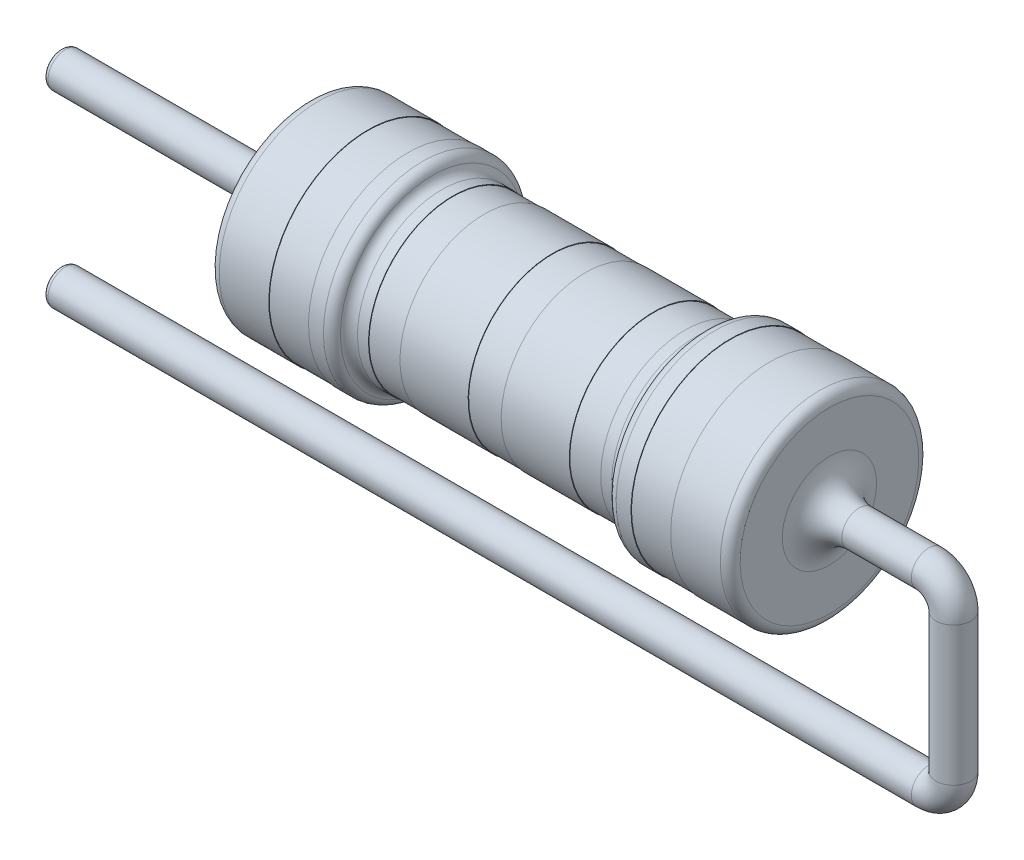
ISO-10303-21;
HEADER;
FILE_DESCRIPTION(('STEP AP214'),'2;1');
FILE_NAME('part.step','',(''),(''),'','','');
FILE_SCHEMA(('AUTOMOTIVE_DESIGN { 1 0 10303 214 1 1 1 1 }'));
ENDSEC;
DATA;
#1=APPLICATION_CONTEXT('core data for automotive mechanical design processes');
#2=APPLICATION_PROTOCOL_DEFINITION('international standard','automotive_design',2000,#1);
#3=PRODUCT_CONTEXT('',#1,'mechanical');
#4=PRODUCT('Part','Part','',(#3));
#5=PRODUCT_RELATED_PRODUCT_CATEGORY('part','',(#4));
#6=PRODUCT_DEFINITION_FORMATION('','',#4);
#7=PRODUCT_DEFINITION_CONTEXT('part definition',#1,'design');
#8=PRODUCT_DEFINITION('design','',#6,#7);
#9=PRODUCT_DEFINITION_SHAPE('','',#8);
#10=(LENGTH_UNIT() NAMED_UNIT(*) SI_UNIT(.MILLI.,.METRE.));
#11=(NAMED_UNIT(*) PLANE_ANGLE_UNIT() SI_UNIT($,.RADIAN.));
#12=(NAMED_UNIT(*) SI_UNIT($,.STERADIAN.) SOLID_ANGLE_UNIT());
#13=UNCERTAINTY_MEASURE_WITH_UNIT(LENGTH_MEASURE(1.E-05),#10,'distance_accuracy_value','');
#14=(GEOMETRIC_REPRESENTATION_CONTEXT(3) GLOBAL_UNCERTAINTY_ASSIGNED_CONTEXT((#13)) GLOBAL_UNIT_ASSIGNED_CONTEXT((#10,
#11,#12)) REPRESENTATION_CONTEXT('',''));
#15=CARTESIAN_POINT('',(0.,0.,0.));
#16=DIRECTION('',(0.,0.,1.));
#17=DIRECTION('',(1.,0.,0.));
#18=AXIS2_PLACEMENT_3D('',#15,#16,#17);
#19=CARTESIAN_POINT('',(5.25,0.,0.));
#20=DIRECTION('',(1.,0.,0.));
#21=DIRECTION('',(0.,1.,0.));
#22=AXIS2_PLACEMENT_3D('',#19,#20,#21);
#23=PLANE('',#22);
#24=CARTESIAN_POINT('',(5.25,0.,0.));
#25=DIRECTION('',(1.,0.,0.));
#26=DIRECTION('',(0.,1.,0.));
#27=AXIS2_PLACEMENT_3D('',#24,#25,#26);
#28=CIRCLE('',#27,0.95);
#29=CARTESIAN_POINT('',(5.25,0.95,0.));
#30=VERTEX_POINT('',#29);
#31=EDGE_CURVE('E45',#30,#30,#28,.F.);
#32=ORIENTED_EDGE('',*,*,#31,.T.);
#33=EDGE_LOOP('',(#32));
#34=FACE_BOUND('',#33,.T.);
#35=CARTESIAN_POINT('',(5.25,0.,0.));
#36=DIRECTION('',(1.,0.,0.));
#37=DIRECTION('',(0.,1.,0.));
#38=AXIS2_PLACEMENT_3D('',#35,#36,#37);
#39=CIRCLE('',#38,1.8);
#40=CARTESIAN_POINT('',(5.25,1.8,0.));
#41=VERTEX_POINT('',#40);
#42=EDGE_CURVE('E66',#41,#41,#39,.T.);
#43=ORIENTED_EDGE('',*,*,#42,.T.);
#44=EDGE_LOOP('',(#43));
#45=FACE_BOUND('',#44,.T.);
#46=ADVANCED_FACE('F34',(#34,#45),#23,.T.);
#47=CARTESIAN_POINT('',(-5.25,0.,0.));
#48=DIRECTION('',(-1.,0.,0.));
#49=DIRECTION('',(0.,-1.,0.));
#50=AXIS2_PLACEMENT_3D('',#47,#48,#49);
#51=CYLINDRICAL_SURFACE('',#50,2.);
#52=CARTESIAN_POINT('',(5.05,0.,0.));
#53=DIRECTION('',(1.,0.,0.));
#54=DIRECTION('',(0.,1.,0.));
#55=AXIS2_PLACEMENT_3D('',#52,#53,#54);
#56=CIRCLE('',#55,2.);
#57=CARTESIAN_POINT('',(5.05,2.,0.));
#58=VERTEX_POINT('',#57);
#59=EDGE_CURVE('E69',#58,#58,#56,.F.);
#60=ORIENTED_EDGE('',*,*,#59,.T.);
#61=EDGE_LOOP('',(#60));
#62=FACE_BOUND('',#61,.T.);
#63=CARTESIAN_POINT('',(4.05,0.,0.));
#64=DIRECTION('',(-1.,0.,0.));
#65=DIRECTION('',(0.,-1.,0.));
#66=AXIS2_PLACEMENT_3D('',#63,#64,#65);
#67=CIRCLE('',#66,2.);
#68=CARTESIAN_POINT('',(4.05,-2.,0.));
#69=VERTEX_POINT('',#68);
#70=EDGE_CURVE('E96',#69,#69,#67,.T.);
#71=ORIENTED_EDGE('',*,*,#70,.F.);
#72=EDGE_LOOP('',(#71));
#73=FACE_BOUND('',#72,.T.);
#74=ADVANCED_FACE('F187',(#62,#73),#51,.T.);
#75=CARTESIAN_POINT('',(4.05,-2.,0.));
#76=DIRECTION('',(-1.,0.,0.));
#77=DIRECTION('',(0.,-1.,0.));
#78=AXIS2_PLACEMENT_3D('',#75,#76,#77);
#79=PLANE('',#78);
#80=ORIENTED_EDGE('',*,*,#70,.T.);
#81=EDGE_LOOP('',(#80));
#82=FACE_BOUND('',#81,.T.);
#83=CARTESIAN_POINT('',(4.05,0.,0.));
#84=DIRECTION('',(-1.,0.,0.));
#85=DIRECTION('',(0.,-1.,0.));
#86=AXIS2_PLACEMENT_3D('',#83,#84,#85);
#87=CIRCLE('',#86,1.99);
#88=CARTESIAN_POINT('',(4.05,-1.99,0.));
#89=VERTEX_POINT('',#88);
#90=EDGE_CURVE('E99',#89,#89,#87,.T.);
#91=ORIENTED_EDGE('',*,*,#90,.F.);
#92=EDGE_LOOP('',(#91));
#93=FACE_BOUND('',#92,.T.);
#94=ADVANCED_FACE('F193',(#82,#93),#79,.T.);
#95=CARTESIAN_POINT('',(-5.25,0.,0.));
#96=DIRECTION('',(-1.,0.,0.));
#97=DIRECTION('',(0.,-1.,0.));
#98=AXIS2_PLACEMENT_3D('',#95,#96,#97);
#99=CYLINDRICAL_SURFACE('',#98,1.99);
#100=ORIENTED_EDGE('',*,*,#90,.T.);
#101=EDGE_LOOP('',(#100));
#102=FACE_BOUND('',#101,.T.);
#103=CARTESIAN_POINT('',(3.25,0.,0.));
#104=DIRECTION('',(-1.,0.,0.));
#105=DIRECTION('',(0.,-1.,0.));
#106=AXIS2_PLACEMENT_3D('',#103,#104,#105);
#107=CIRCLE('',#106,1.99);
#108=CARTESIAN_POINT('',(3.25,-1.99,0.));
#109=VERTEX_POINT('',#108);
#110=EDGE_CURVE('E102',#109,#109,#107,.T.);
#111=ORIENTED_EDGE('',*,*,#110,.F.);
#112=EDGE_LOOP('',(#111));
#113=FACE_BOUND('',#112,.T.);
#114=ADVANCED_FACE('F596',(#102,#113),#99,.T.);
#115=CARTESIAN_POINT('',(3.25,-1.99,0.));
#116=DIRECTION('',(1.,0.,0.));
#117=DIRECTION('',(0.,1.,0.));
#118=AXIS2_PLACEMENT_3D('',#115,#116,#117);
#119=PLANE('',#118);
#120=ORIENTED_EDGE('',*,*,#110,.T.);
#121=EDGE_LOOP('',(#120));
#122=FACE_BOUND('',#121,.T.);
#123=CARTESIAN_POINT('',(3.25,0.,0.));
#124=DIRECTION('',(-1.,0.,0.));
#125=DIRECTION('',(0.,-1.,0.));
#126=AXIS2_PLACEMENT_3D('',#123,#124,#125);
#127=CIRCLE('',#126,2.);
#128=CARTESIAN_POINT('',(3.25,-2.,0.));
#129=VERTEX_POINT('',#128);
#130=EDGE_CURVE('E105',#129,#129,#127,.T.);
#131=ORIENTED_EDGE('',*,*,#130,.F.);
#132=EDGE_LOOP('',(#131));
#133=FACE_BOUND('',#132,.T.);
#134=ADVANCED_FACE('F443',(#122,#133),#119,.T.);
#135=CARTESIAN_POINT('',(-5.25,0.,0.));
#136=DIRECTION('',(-1.,0.,0.));
#137=DIRECTION('',(0.,-1.,0.));
#138=AXIS2_PLACEMENT_3D('',#135,#136,#137);
#139=CYLINDRICAL_SURFACE('',#138,2.);
#140=CARTESIAN_POINT('',(2.95,0.,0.));
#141=DIRECTION('',(-1.,0.,0.));
#142=DIRECTION('',(0.,-1.,0.));
#143=AXIS2_PLACEMENT_3D('',#140,#141,#142);
#144=CIRCLE('',#143,2.);
#145=CARTESIAN_POINT('',(2.95,-2.,0.));
#146=VERTEX_POINT('',#145);
#147=EDGE_CURVE('E84',#146,#146,#144,.F.);
#148=ORIENTED_EDGE('',*,*,#147,.T.);
#149=EDGE_LOOP('',(#148));
#150=FACE_BOUND('',#149,.T.);
#151=ORIENTED_EDGE('',*,*,#130,.T.);
#152=EDGE_LOOP('',(#151));
#153=FACE_BOUND('',#152,.T.);
#154=ADVANCED_FACE('F405',(#150,#153),#139,.T.);
#155=CARTESIAN_POINT('',(-5.25,0.,0.));
#156=DIRECTION('',(-1.,0.,0.));
#157=DIRECTION('',(0.,-1.,0.));
#158=AXIS2_PLACEMENT_3D('',#155,#156,#157);
#159=CYLINDRICAL_SURFACE('',#158,1.7);
#160=CARTESIAN_POINT('',(2.5627016653792,0.,0.));
#161=DIRECTION('',(-1.,0.,0.));
#162=DIRECTION('',(0.,-1.,0.));
#163=AXIS2_PLACEMENT_3D('',#160,#161,#162);
#164=CIRCLE('',#163,1.7);
#165=CARTESIAN_POINT('',(2.5627016653792,-1.7,0.));
#166=VERTEX_POINT('',#165);
#167=EDGE_CURVE('E81',#166,#166,#164,.T.);
#168=ORIENTED_EDGE('',*,*,#167,.T.);
#169=EDGE_LOOP('',(#168));
#170=FACE_BOUND('',#169,.T.);
#171=CARTESIAN_POINT('',(2.34069006093189,0.,0.));
#172=DIRECTION('',(-1.,0.,0.));
#173=DIRECTION('',(0.,-1.,0.));
#174=AXIS2_PLACEMENT_3D('',#171,#172,#173);
#175=CIRCLE('',#174,1.7);
#176=CARTESIAN_POINT('',(2.34069006093189,-1.7,0.));
#177=VERTEX_POINT('',#176);
#178=EDGE_CURVE('E108',#177,#177,#175,.T.);
#179=ORIENTED_EDGE('',*,*,#178,.F.);
#180=EDGE_LOOP('',(#179));
#181=FACE_BOUND('',#180,.T.);
#182=ADVANCED_FACE('F399',(#170,#181),#159,.T.);
#183=CARTESIAN_POINT('',(2.3406900609319,-1.7,0.));
#184=DIRECTION('',(-1.,0.,0.));
#185=DIRECTION('',(0.,-1.,0.));
#186=AXIS2_PLACEMENT_3D('',#183,#184,#185);
#187=PLANE('',#186);
#188=ORIENTED_EDGE('',*,*,#178,.T.);
#189=EDGE_LOOP('',(#188));
#190=FACE_BOUND('',#189,.T.);
#191=CARTESIAN_POINT('',(2.34069006093189,0.,0.));
#192=DIRECTION('',(-1.,0.,0.));
#193=DIRECTION('',(0.,-1.,0.));
#194=AXIS2_PLACEMENT_3D('',#191,#192,#193);
#195=CIRCLE('',#194,1.69);
#196=CARTESIAN_POINT('',(2.34069006093189,-1.69,0.));
#197=VERTEX_POINT('',#196);
#198=EDGE_CURVE('E111',#197,#197,#195,.T.);
#199=ORIENTED_EDGE('',*,*,#198,.F.);
#200=EDGE_LOOP('',(#199));
#201=FACE_BOUND('',#200,.T.);
#202=ADVANCED_FACE('F404',(#190,#201),#187,.T.);
#203=CARTESIAN_POINT('',(-5.25,0.,0.));
#204=DIRECTION('',(-1.,0.,0.));
#205=DIRECTION('',(0.,-1.,0.));
#206=AXIS2_PLACEMENT_3D('',#203,#204,#205);
#207=CYLINDRICAL_SURFACE('',#206,1.69);
#208=ORIENTED_EDGE('',*,*,#198,.T.);
#209=EDGE_LOOP('',(#208));
#210=FACE_BOUND('',#209,.T.);
#211=CARTESIAN_POINT('',(1.70680528042174,0.,0.));
#212=DIRECTION('',(-1.,0.,0.));
#213=DIRECTION('',(0.,-1.,0.));
#214=AXIS2_PLACEMENT_3D('',#211,#212,#213);
#215=CIRCLE('',#214,1.69);
#216=CARTESIAN_POINT('',(1.70680528042174,-1.69,0.));
#217=VERTEX_POINT('',#216);
#218=EDGE_CURVE('E114',#217,#217,#215,.T.);
#219=ORIENTED_EDGE('',*,*,#218,.F.);
#220=EDGE_LOOP('',(#219));
#221=FACE_BOUND('',#220,.T.);
#222=ADVANCED_FACE('F571',(#210,#221),#207,.T.);
#223=CARTESIAN_POINT('',(1.70680528042174,-1.69,0.));
#224=DIRECTION('',(1.,0.,0.));
#225=DIRECTION('',(0.,1.,0.));
#226=AXIS2_PLACEMENT_3D('',#223,#224,#225);
#227=PLANE('',#226);
#228=ORIENTED_EDGE('',*,*,#218,.T.);
#229=EDGE_LOOP('',(#228));
#230=FACE_BOUND('',#229,.T.);
#231=CARTESIAN_POINT('',(1.70680528042174,0.,0.));
#232=DIRECTION('',(-1.,0.,0.));
#233=DIRECTION('',(0.,-1.,0.));
#234=AXIS2_PLACEMENT_3D('',#231,#232,#233);
#235=CIRCLE('',#234,1.7);
#236=CARTESIAN_POINT('',(1.70680528042174,-1.7,0.));
#237=VERTEX_POINT('',#236);
#238=EDGE_CURVE('E117',#237,#237,#235,.T.);
#239=ORIENTED_EDGE('',*,*,#238,.F.);
#240=EDGE_LOOP('',(#239));
#241=FACE_BOUND('',#240,.T.);
#242=ADVANCED_FACE('F561',(#230,#241),#227,.T.);
#243=CARTESIAN_POINT('',(-5.25,0.,0.));
#244=DIRECTION('',(-1.,0.,0.));
#245=DIRECTION('',(0.,-1.,0.));
#246=AXIS2_PLACEMENT_3D('',#243,#244,#245);
#247=CYLINDRICAL_SURFACE('',#246,1.7);
#248=ORIENTED_EDGE('',*,*,#238,.T.);
#249=EDGE_LOOP('',(#248));
#250=FACE_BOUND('',#249,.T.);
#251=CARTESIAN_POINT('',(0.332543076275725,0.,0.));
#252=DIRECTION('',(-1.,0.,0.));
#253=DIRECTION('',(0.,-1.,0.));
#254=AXIS2_PLACEMENT_3D('',#251,#252,#253);
#255=CIRCLE('',#254,1.7);
#256=CARTESIAN_POINT('',(0.332543076275725,-1.7,0.));
#257=VERTEX_POINT('',#256);
#258=EDGE_CURVE('E120',#257,#257,#255,.T.);
#259=ORIENTED_EDGE('',*,*,#258,.F.);
#260=EDGE_LOOP('',(#259));
#261=FACE_BOUND('',#260,.T.);
#262=ADVANCED_FACE('F551',(#250,#261),#247,.T.);
#263=CARTESIAN_POINT('',(0.332543076275725,-1.7,0.));
#264=DIRECTION('',(-1.,0.,0.));
#265=DIRECTION('',(0.,-1.,0.));
#266=AXIS2_PLACEMENT_3D('',#263,#264,#265);
#267=PLANE('',#266);
#268=ORIENTED_EDGE('',*,*,#258,.T.);
#269=EDGE_LOOP('',(#268));
#270=FACE_BOUND('',#269,.T.);
#271=CARTESIAN_POINT('',(0.332543076275725,0.,0.));
#272=DIRECTION('',(-1.,0.,0.));
#273=DIRECTION('',(0.,-1.,0.));
#274=AXIS2_PLACEMENT_3D('',#271,#272,#273);
#275=CIRCLE('',#274,1.69);
#276=CARTESIAN_POINT('',(0.332543076275725,-1.69,0.));
#277=VERTEX_POINT('',#276);
#278=EDGE_CURVE('E123',#277,#277,#275,.T.);
#279=ORIENTED_EDGE('',*,*,#278,.F.);
#280=EDGE_LOOP('',(#279));
#281=FACE_BOUND('',#280,.T.);
#282=ADVANCED_FACE('F540',(#270,#281),#267,.T.);
#283=CARTESIAN_POINT('',(-5.25,0.,0.));
#284=DIRECTION('',(-1.,0.,0.));
#285=DIRECTION('',(0.,-1.,0.));
#286=AXIS2_PLACEMENT_3D('',#283,#284,#285);
#287=CYLINDRICAL_SURFACE('',#286,1.69);
#288=ORIENTED_EDGE('',*,*,#278,.T.);
#289=EDGE_LOOP('',(#288));
#290=FACE_BOUND('',#289,.T.);
#291=CARTESIAN_POINT('',(-0.332543076275725,0.,0.));
#292=DIRECTION('',(-1.,0.,0.));
#293=DIRECTION('',(0.,-1.,0.));
#294=AXIS2_PLACEMENT_3D('',#291,#292,#293);
#295=CIRCLE('',#294,1.69);
#296=CARTESIAN_POINT('',(-0.332543076275725,-1.69,0.));
#297=VERTEX_POINT('',#296);
#298=EDGE_CURVE('E126',#297,#297,#295,.T.);
#299=ORIENTED_EDGE('',*,*,#298,.F.);
#300=EDGE_LOOP('',(#299));
#301=FACE_BOUND('',#300,.T.);
#302=ADVANCED_FACE('F530',(#290,#301),#287,.T.);
#303=CARTESIAN_POINT('',(-0.332543076275725,-1.7,0.));
#304=DIRECTION('',(1.,0.,0.));
#305=DIRECTION('',(0.,1.,0.));
#306=AXIS2_PLACEMENT_3D('',#303,#304,#305);
#307=PLANE('',#306);
#308=ORIENTED_EDGE('',*,*,#298,.T.);
#309=EDGE_LOOP('',(#308));
#310=FACE_BOUND('',#309,.T.);
#311=CARTESIAN_POINT('',(-0.332543076275725,0.,0.));
#312=DIRECTION('',(-1.,0.,0.));
#313=DIRECTION('',(0.,-1.,0.));
#314=AXIS2_PLACEMENT_3D('',#311,#312,#313);
#315=CIRCLE('',#314,1.7);
#316=CARTESIAN_POINT('',(-0.332543076275725,-1.7,0.));
#317=VERTEX_POINT('',#316);
#318=EDGE_CURVE('E129',#317,#317,#315,.T.);
#319=ORIENTED_EDGE('',*,*,#318,.F.);
#320=EDGE_LOOP('',(#319));
#321=FACE_BOUND('',#320,.T.);
#322=ADVANCED_FACE('F520',(#310,#321),#307,.T.);
#323=CARTESIAN_POINT('',(-5.25,0.,0.));
#324=DIRECTION('',(-1.,0.,0.));
#325=DIRECTION('',(0.,-1.,0.));
#326=AXIS2_PLACEMENT_3D('',#323,#324,#325);
#327=CYLINDRICAL_SURFACE('',#326,1.7);
#328=ORIENTED_EDGE('',*,*,#318,.T.);
#329=EDGE_LOOP('',(#328));
#330=FACE_BOUND('',#329,.T.);
#331=CARTESIAN_POINT('',(-1.70680528042174,0.,0.));
#332=DIRECTION('',(-1.,0.,0.));
#333=DIRECTION('',(0.,-1.,0.));
#334=AXIS2_PLACEMENT_3D('',#331,#332,#333);
#335=CIRCLE('',#334,1.7);
#336=CARTESIAN_POINT('',(-1.70680528042174,-1.7,0.));
#337=VERTEX_POINT('',#336);
#338=EDGE_CURVE('E132',#337,#337,#335,.T.);
#339=ORIENTED_EDGE('',*,*,#338,.F.);
#340=EDGE_LOOP('',(#339));
#341=FACE_BOUND('',#340,.T.);
#342=ADVANCED_FACE('F510',(#330,#341),#327,.T.);
#343=CARTESIAN_POINT('',(-1.70680528042174,-1.69,0.));
#344=DIRECTION('',(-1.,0.,0.));
#345=DIRECTION('',(0.,-1.,0.));
#346=AXIS2_PLACEMENT_3D('',#343,#344,#345);
#347=PLANE('',#346);
#348=ORIENTED_EDGE('',*,*,#338,.T.);
#349=EDGE_LOOP('',(#348));
#350=FACE_BOUND('',#349,.T.);
#351=CARTESIAN_POINT('',(-1.70680528042174,0.,0.));
#352=DIRECTION('',(-1.,0.,0.));
#353=DIRECTION('',(0.,-1.,0.));
#354=AXIS2_PLACEMENT_3D('',#351,#352,#353);
#355=CIRCLE('',#354,1.69);
#356=CARTESIAN_POINT('',(-1.70680528042174,-1.69,0.));
#357=VERTEX_POINT('',#356);
#358=EDGE_CURVE('E135',#357,#357,#355,.T.);
#359=ORIENTED_EDGE('',*,*,#358,.F.);
#360=EDGE_LOOP('',(#359));
#361=FACE_BOUND('',#360,.T.);
#362=ADVANCED_FACE('F499',(#350,#361),#347,.T.);
#363=CARTESIAN_POINT('',(-5.25,0.,0.));
#364=DIRECTION('',(-1.,0.,0.));
#365=DIRECTION('',(0.,-1.,0.));
#366=AXIS2_PLACEMENT_3D('',#363,#364,#365);
#367=CYLINDRICAL_SURFACE('',#366,1.69);
#368=ORIENTED_EDGE('',*,*,#358,.T.);
#369=EDGE_LOOP('',(#368));
#370=FACE_BOUND('',#369,.T.);
#371=CARTESIAN_POINT('',(-2.3406900609319,0.,0.));
#372=DIRECTION('',(-1.,0.,0.));
#373=DIRECTION('',(0.,-1.,0.));
#374=AXIS2_PLACEMENT_3D('',#371,#372,#373);
#375=CIRCLE('',#374,1.69);
#376=CARTESIAN_POINT('',(-2.3406900609319,-1.69,0.));
#377=VERTEX_POINT('',#376);
#378=EDGE_CURVE('E138',#377,#377,#375,.T.);
#379=ORIENTED_EDGE('',*,*,#378,.F.);
#380=EDGE_LOOP('',(#379));
#381=FACE_BOUND('',#380,.T.);
#382=ADVANCED_FACE('F489',(#370,#381),#367,.T.);
#383=CARTESIAN_POINT('',(-2.3406900609319,-1.7,0.));
#384=DIRECTION('',(1.,0.,0.));
#385=DIRECTION('',(0.,1.,0.));
#386=AXIS2_PLACEMENT_3D('',#383,#384,#385);
#387=PLANE('',#386);
#388=ORIENTED_EDGE('',*,*,#378,.T.);
#389=EDGE_LOOP('',(#388));
#390=FACE_BOUND('',#389,.T.);
#391=CARTESIAN_POINT('',(-2.3406900609319,0.,0.));
#392=DIRECTION('',(-1.,0.,0.));
#393=DIRECTION('',(0.,-1.,0.));
#394=AXIS2_PLACEMENT_3D('',#391,#392,#393);
#395=CIRCLE('',#394,1.7);
#396=CARTESIAN_POINT('',(-2.3406900609319,-1.7,0.));
#397=VERTEX_POINT('',#396);
#398=EDGE_CURVE('E141',#397,#397,#395,.T.);
#399=ORIENTED_EDGE('',*,*,#398,.F.);
#400=EDGE_LOOP('',(#399));
#401=FACE_BOUND('',#400,.T.);
#402=ADVANCED_FACE('F431',(#390,#401),#387,.T.);
#403=CARTESIAN_POINT('',(-5.25,0.,0.));
#404=DIRECTION('',(-1.,0.,0.));
#405=DIRECTION('',(0.,-1.,0.));
#406=AXIS2_PLACEMENT_3D('',#403,#404,#405);
#407=CYLINDRICAL_SURFACE('',#406,1.7);
#408=CARTESIAN_POINT('',(-2.56270166537917,0.,0.));
#409=DIRECTION('',(-1.,0.,0.));
#410=DIRECTION('',(0.,-1.,0.));
#411=AXIS2_PLACEMENT_3D('',#408,#409,#410);
#412=CIRCLE('',#411,1.7);
#413=CARTESIAN_POINT('',(-2.56270166537917,-1.7,0.));
#414=VERTEX_POINT('',#413);
#415=EDGE_CURVE('E87',#414,#414,#412,.F.);
#416=ORIENTED_EDGE('',*,*,#415,.T.);
#417=EDGE_LOOP('',(#416));
#418=FACE_BOUND('',#417,.T.);
#419=ORIENTED_EDGE('',*,*,#398,.T.);
#420=EDGE_LOOP('',(#419));
#421=FACE_BOUND('',#420,.T.);
#422=ADVANCED_FACE('F425',(#418,#421),#407,.T.);
#423=CARTESIAN_POINT('',(-5.25,0.,0.));
#424=DIRECTION('',(-1.,0.,0.));
#425=DIRECTION('',(0.,-1.,0.));
#426=AXIS2_PLACEMENT_3D('',#423,#424,#425);
#427=CYLINDRICAL_SURFACE('',#426,2.);
#428=CARTESIAN_POINT('',(-2.95,0.,0.));
#429=DIRECTION('',(1.,0.,0.));
#430=DIRECTION('',(0.,1.,0.));
#431=AXIS2_PLACEMENT_3D('',#428,#429,#430);
#432=CIRCLE('',#431,2.);
#433=CARTESIAN_POINT('',(-2.95,2.,0.));
#434=VERTEX_POINT('',#433);
#435=EDGE_CURVE('E93',#434,#434,#432,.F.);
#436=ORIENTED_EDGE('',*,*,#435,.T.);
#437=EDGE_LOOP('',(#436));
#438=FACE_BOUND('',#437,.T.);
#439=CARTESIAN_POINT('',(-3.25,0.,0.));
#440=DIRECTION('',(-1.,0.,0.));
#441=DIRECTION('',(0.,-1.,0.));
#442=AXIS2_PLACEMENT_3D('',#439,#440,#441);
#443=CIRCLE('',#442,2.);
#444=CARTESIAN_POINT('',(-3.25,-2.,0.));
#445=VERTEX_POINT('',#444);
#446=EDGE_CURVE('E144',#445,#445,#443,.T.);
#447=ORIENTED_EDGE('',*,*,#446,.F.);
#448=EDGE_LOOP('',(#447));
#449=FACE_BOUND('',#448,.T.);
#450=ADVANCED_FACE('F430',(#438,#449),#427,.T.);
#451=CARTESIAN_POINT('',(-3.25,-1.99,0.));
#452=DIRECTION('',(-1.,0.,0.));
#453=DIRECTION('',(0.,-1.,0.));
#454=AXIS2_PLACEMENT_3D('',#451,#452,#453);
#455=PLANE('',#454);
#456=ORIENTED_EDGE('',*,*,#446,.T.);
#457=EDGE_LOOP('',(#456));
#458=FACE_BOUND('',#457,.T.);
#459=CARTESIAN_POINT('',(-3.25,0.,0.));
#460=DIRECTION('',(-1.,0.,0.));
#461=DIRECTION('',(0.,-1.,0.));
#462=AXIS2_PLACEMENT_3D('',#459,#460,#461);
#463=CIRCLE('',#462,1.99);
#464=CARTESIAN_POINT('',(-3.25,-1.99,0.));
#465=VERTEX_POINT('',#464);
#466=EDGE_CURVE('E147',#465,#465,#463,.T.);
#467=ORIENTED_EDGE('',*,*,#466,.F.);
#468=EDGE_LOOP('',(#467));
#469=FACE_BOUND('',#468,.T.);
#470=ADVANCED_FACE('F453',(#458,#469),#455,.T.);
#471=CARTESIAN_POINT('',(-5.25,0.,0.));
#472=DIRECTION('',(-1.,0.,0.));
#473=DIRECTION('',(0.,-1.,0.));
#474=AXIS2_PLACEMENT_3D('',#471,#472,#473);
#475=CYLINDRICAL_SURFACE('',#474,1.99);
#476=ORIENTED_EDGE('',*,*,#466,.T.);
#477=EDGE_LOOP('',(#476));
#478=FACE_BOUND('',#477,.T.);
#479=CARTESIAN_POINT('',(-4.05,0.,0.));
#480=DIRECTION('',(-1.,0.,0.));
#481=DIRECTION('',(0.,-1.,0.));
#482=AXIS2_PLACEMENT_3D('',#479,#480,#481);
#483=CIRCLE('',#482,1.99);
#484=CARTESIAN_POINT('',(-4.05,-1.99,0.));
#485=VERTEX_POINT('',#484);
#486=EDGE_CURVE('E150',#485,#485,#483,.T.);
#487=ORIENTED_EDGE('',*,*,#486,.F.);
#488=EDGE_LOOP('',(#487));
#489=FACE_BOUND('',#488,.T.);
#490=ADVANCED_FACE('F463',(#478,#489),#475,.T.);
#491=CARTESIAN_POINT('',(-4.05,-2.,0.));
#492=DIRECTION('',(1.,0.,0.));
#493=DIRECTION('',(0.,1.,0.));
#494=AXIS2_PLACEMENT_3D('',#491,#492,#493);
#495=PLANE('',#494);
#496=ORIENTED_EDGE('',*,*,#486,.T.);
#497=EDGE_LOOP('',(#496));
#498=FACE_BOUND('',#497,.T.);
#499=CARTESIAN_POINT('',(-4.05,0.,0.));
#500=DIRECTION('',(-1.,0.,0.));
#501=DIRECTION('',(0.,-1.,0.));
#502=AXIS2_PLACEMENT_3D('',#499,#500,#501);
#503=CIRCLE('',#502,2.);
#504=CARTESIAN_POINT('',(-4.05,-2.,0.));
#505=VERTEX_POINT('',#504);
#506=EDGE_CURVE('E153',#505,#505,#503,.T.);
#507=ORIENTED_EDGE('',*,*,#506,.F.);
#508=EDGE_LOOP('',(#507));
#509=FACE_BOUND('',#508,.T.);
#510=ADVANCED_FACE('F379',(#498,#509),#495,.T.);
#511=CARTESIAN_POINT('',(-5.25,0.,0.));
#512=DIRECTION('',(-1.,0.,0.));
#513=DIRECTION('',(0.,-1.,0.));
#514=AXIS2_PLACEMENT_3D('',#511,#512,#513);
#515=CYLINDRICAL_SURFACE('',#514,2.);
#516=CARTESIAN_POINT('',(-5.05,0.,0.));
#517=DIRECTION('',(-1.,0.,0.));
#518=DIRECTION('',(0.,-1.,0.));
#519=AXIS2_PLACEMENT_3D('',#516,#517,#518);
#520=CIRCLE('',#519,2.);
#521=CARTESIAN_POINT('',(-5.05,-2.,0.));
#522=VERTEX_POINT('',#521);
#523=EDGE_CURVE('E72',#522,#522,#520,.F.);
#524=ORIENTED_EDGE('',*,*,#523,.T.);
#525=EDGE_LOOP('',(#524));
#526=FACE_BOUND('',#525,.T.);
#527=ORIENTED_EDGE('',*,*,#506,.T.);
#528=EDGE_LOOP('',(#527));
#529=FACE_BOUND('',#528,.T.);
#530=ADVANCED_FACE('F278',(#526,#529),#515,.T.);
#531=CARTESIAN_POINT('',(-5.25,0.,0.));
#532=DIRECTION('',(-1.,0.,0.));
#533=DIRECTION('',(0.,-1.,0.));
#534=AXIS2_PLACEMENT_3D('',#531,#532,#533);
#535=PLANE('',#534);
#536=CARTESIAN_POINT('',(-5.25,0.,0.));
#537=DIRECTION('',(-1.,0.,0.));
#538=DIRECTION('',(0.,-1.,0.));
#539=AXIS2_PLACEMENT_3D('',#536,#537,#538);
#540=CIRCLE('',#539,0.95);
#541=CARTESIAN_POINT('',(-5.25,-0.95,0.));
#542=VERTEX_POINT('',#541);
#543=EDGE_CURVE('E10',#542,#542,#540,.F.);
#544=ORIENTED_EDGE('',*,*,#543,.T.);
#545=EDGE_LOOP('',(#544));
#546=FACE_BOUND('',#545,.T.);
#547=CARTESIAN_POINT('',(-5.25,0.,0.));
#548=DIRECTION('',(-1.,0.,0.));
#549=DIRECTION('',(0.,-1.,0.));
#550=AXIS2_PLACEMENT_3D('',#547,#548,#549);
#551=CIRCLE('',#550,1.8);
#552=CARTESIAN_POINT('',(-5.25,-1.8,0.));
#553=VERTEX_POINT('',#552);
#554=EDGE_CURVE('E75',#553,#553,#551,.T.);
#555=ORIENTED_EDGE('',*,*,#554,.T.);
#556=EDGE_LOOP('',(#555));
#557=FACE_BOUND('',#556,.T.);
#558=ADVANCED_FACE('F203',(#546,#557),#535,.T.);
#559=CARTESIAN_POINT('',(-2.95,0.,0.));
#560=DIRECTION('',(1.,0.,0.));
#561=DIRECTION('',(0.,1.,0.));
#562=AXIS2_PLACEMENT_3D('',#559,#560,#561);
#563=TOROIDAL_SURFACE('',#562,1.8,0.2);
#564=CARTESIAN_POINT('',(-2.75635083268959,0.,0.));
#565=DIRECTION('',(-1.,0.,0.));
#566=DIRECTION('',(0.,-1.,0.));
#567=AXIS2_PLACEMENT_3D('',#564,#565,#566);
#568=CIRCLE('',#567,1.84999999999999);
#569=CARTESIAN_POINT('',(-2.75635083268959,-1.84999999999999,0.));
#570=VERTEX_POINT('',#569);
#571=EDGE_CURVE('E90',#570,#570,#568,.T.);
#572=ORIENTED_EDGE('',*,*,#571,.T.);
#573=EDGE_LOOP('',(#572));
#574=FACE_BOUND('',#573,.T.);
#575=ORIENTED_EDGE('',*,*,#435,.F.);
#576=EDGE_LOOP('',(#575));
#577=FACE_BOUND('',#576,.T.);
#578=ADVANCED_FACE('F199',(#574,#577),#563,.T.);
#579=CARTESIAN_POINT('',(-2.56270166537917,0.,0.));
#580=DIRECTION('',(-1.,0.,0.));
#581=DIRECTION('',(0.,-1.,0.));
#582=AXIS2_PLACEMENT_3D('',#579,#580,#581);
#583=TOROIDAL_SURFACE('',#582,1.89999999999998,0.2);
#584=ORIENTED_EDGE('',*,*,#415,.F.);
#585=EDGE_LOOP('',(#584));
#586=FACE_BOUND('',#585,.T.);
#587=ORIENTED_EDGE('',*,*,#571,.F.);
#588=EDGE_LOOP('',(#587));
#589=FACE_BOUND('',#588,.T.);
#590=ADVANCED_FACE('F202',(#586,#589),#583,.F.);
#591=CARTESIAN_POINT('',(2.95,0.,0.));
#592=DIRECTION('',(-1.,0.,0.));
#593=DIRECTION('',(0.,-1.,0.));
#594=AXIS2_PLACEMENT_3D('',#591,#592,#593);
#595=TOROIDAL_SURFACE('',#594,1.8,0.2);
#596=CARTESIAN_POINT('',(2.75635083268959,0.,0.));
#597=DIRECTION('',(1.,0.,0.));
#598=DIRECTION('',(0.,1.,0.));
#599=AXIS2_PLACEMENT_3D('',#596,#597,#598);
#600=CIRCLE('',#599,1.85);
#601=CARTESIAN_POINT('',(2.75635083268959,1.85,0.));
#602=VERTEX_POINT('',#601);
#603=EDGE_CURVE('E78',#602,#602,#600,.T.);
#604=ORIENTED_EDGE('',*,*,#603,.T.);
#605=EDGE_LOOP('',(#604));
#606=FACE_BOUND('',#605,.T.);
#607=ORIENTED_EDGE('',*,*,#147,.F.);
#608=EDGE_LOOP('',(#607));
#609=FACE_BOUND('',#608,.T.);
#610=ADVANCED_FACE('F207',(#606,#609),#595,.T.);
#611=CARTESIAN_POINT('',(2.5627016653792,0.,0.));
#612=DIRECTION('',(-1.,0.,0.));
#613=DIRECTION('',(0.,-1.,0.));
#614=AXIS2_PLACEMENT_3D('',#611,#612,#613);
#615=TOROIDAL_SURFACE('',#614,1.89999999999999,0.2);
#616=ORIENTED_EDGE('',*,*,#603,.F.);
#617=EDGE_LOOP('',(#616));
#618=FACE_BOUND('',#617,.T.);
#619=ORIENTED_EDGE('',*,*,#167,.F.);
#620=EDGE_LOOP('',(#619));
#621=FACE_BOUND('',#620,.T.);
#622=ADVANCED_FACE('F211',(#618,#621),#615,.F.);
#623=CARTESIAN_POINT('',(-5.05,0.,0.));
#624=DIRECTION('',(-1.,0.,0.));
#625=DIRECTION('',(0.,-1.,0.));
#626=AXIS2_PLACEMENT_3D('',#623,#624,#625);
#627=TOROIDAL_SURFACE('',#626,1.8,0.2);
#628=ORIENTED_EDGE('',*,*,#523,.F.);
#629=EDGE_LOOP('',(#628));
#630=FACE_BOUND('',#629,.T.);
#631=ORIENTED_EDGE('',*,*,#554,.F.);
#632=EDGE_LOOP('',(#631));
#633=FACE_BOUND('',#632,.T.);
#634=ADVANCED_FACE('F215',(#630,#633),#627,.T.);
#635=CARTESIAN_POINT('',(5.05,0.,0.));
#636=DIRECTION('',(1.,0.,0.));
#637=DIRECTION('',(0.,1.,0.));
#638=AXIS2_PLACEMENT_3D('',#635,#636,#637);
#639=TOROIDAL_SURFACE('',#638,1.8,0.2);
#640=ORIENTED_EDGE('',*,*,#42,.F.);
#641=EDGE_LOOP('',(#640));
#642=FACE_BOUND('',#641,.T.);
#643=ORIENTED_EDGE('',*,*,#59,.F.);
#644=EDGE_LOOP('',(#643));
#645=FACE_BOUND('',#644,.T.);
#646=ADVANCED_FACE('F219',(#642,#645),#639,.T.);
#647=CARTESIAN_POINT('',(7.25,-3.79631303312024,0.));
#648=DIRECTION('',(-1.,0.,0.));
#649=DIRECTION('',(0.,0.,1.));
#650=AXIS2_PLACEMENT_3D('',#647,#648,#649);
#651=CYLINDRICAL_SURFACE('',#650,0.35);
#652=CARTESIAN_POINT('',(-10.15,-3.79631303312024,0.));
#653=DIRECTION('',(-1.,0.,0.));
#654=DIRECTION('',(0.,-1.,0.));
#655=AXIS2_PLACEMENT_3D('',#652,#653,#654);
#656=CIRCLE('',#655,0.35);
#657=CARTESIAN_POINT('',(-10.15,-4.14631303312024,0.));
#658=VERTEX_POINT('',#657);
#659=EDGE_CURVE('E60',#658,#658,#656,.F.);
#660=ORIENTED_EDGE('',*,*,#659,.T.);
#661=EDGE_LOOP('',(#660));
#662=FACE_BOUND('',#661,.T.);
#663=CARTESIAN_POINT('',(7.25,-3.79631303312024,0.));
#664=DIRECTION('',(-1.,0.,0.));
#665=DIRECTION('',(0.,-1.,0.));
#666=AXIS2_PLACEMENT_3D('',#663,#664,#665);
#667=CIRCLE('',#666,0.35);
#668=CARTESIAN_POINT('',(7.25,-4.14631303312024,0.));
#669=VERTEX_POINT('',#668);
#670=EDGE_CURVE('E156',#669,#669,#667,.T.);
#671=ORIENTED_EDGE('',*,*,#670,.T.);
#672=EDGE_LOOP('',(#671));
#673=FACE_BOUND('',#672,.T.);
#674=ADVANCED_FACE('F223',(#662,#673),#651,.T.);
#675=CARTESIAN_POINT('',(7.25,-3.29631303312024,0.));
#676=DIRECTION('',(0.,0.,-1.));
#677=DIRECTION('',(-1.,0.,0.));
#678=AXIS2_PLACEMENT_3D('',#675,#676,#677);
#679=TOROIDAL_SURFACE('',#678,0.5,0.35);
#680=CARTESIAN_POINT('',(7.75,-3.29631303312024,0.));
#681=DIRECTION('',(0.,-1.,0.));
#682=DIRECTION('',(1.,0.,0.));
#683=AXIS2_PLACEMENT_3D('',#680,#681,#682);
#684=CIRCLE('',#683,0.35);
#685=CARTESIAN_POINT('',(8.1,-3.29631303312024,0.));
#686=VERTEX_POINT('',#685);
#687=EDGE_CURVE('E159',#686,#686,#684,.T.);
#688=CARTESIAN_POINT('',(7.25,-3.29631303312024,0.));
#689=DIRECTION('',(0.,0.,-1.));
#690=DIRECTION('',(-1.,0.,0.));
#691=AXIS2_PLACEMENT_3D('',#688,#689,#690);
#692=CIRCLE('',#691,0.85);
#693=EDGE_CURVE('',#686,#669,#692,.T.);
#694=ORIENTED_EDGE('',*,*,#687,.T.);
#695=ORIENTED_EDGE('',*,*,#670,.F.);
#696=ORIENTED_EDGE('',*,*,#693,.T.);
#697=ORIENTED_EDGE('',*,*,#693,.F.);
#698=EDGE_LOOP('',(#694,#696,#695,#697));
#699=FACE_BOUND('',#698,.T.);
#700=ADVANCED_FACE('F325',(#699),#679,.T.);
#701=CARTESIAN_POINT('',(7.75,-0.5,0.));
#702=DIRECTION('',(0.,-1.,0.));
#703=DIRECTION('',(0.,0.,-1.));
#704=AXIS2_PLACEMENT_3D('',#701,#702,#703);
#705=CYLINDRICAL_SURFACE('',#704,0.35);
#706=CARTESIAN_POINT('',(7.75,-0.5,0.));
#707=DIRECTION('',(0.,-1.,0.));
#708=DIRECTION('',(1.,0.,0.));
#709=AXIS2_PLACEMENT_3D('',#706,#707,#708);
#710=CIRCLE('',#709,0.35);
#711=CARTESIAN_POINT('',(8.1,-0.500000000000001,0.));
#712=VERTEX_POINT('',#711);
#713=EDGE_CURVE('E162',#712,#712,#710,.T.);
#714=ORIENTED_EDGE('',*,*,#713,.T.);
#715=EDGE_LOOP('',(#714));
#716=FACE_BOUND('',#715,.T.);
#717=ORIENTED_EDGE('',*,*,#687,.F.);
#718=EDGE_LOOP('',(#717));
#719=FACE_BOUND('',#718,.T.);
#720=ADVANCED_FACE('F184',(#716,#719),#705,.T.);
#721=CARTESIAN_POINT('',(7.25,-0.5,0.));
#722=DIRECTION('',(0.,0.,-1.));
#723=DIRECTION('',(-1.,0.,0.));
#724=AXIS2_PLACEMENT_3D('',#721,#722,#723);
#725=TOROIDAL_SURFACE('',#724,0.5,0.35);
#726=CARTESIAN_POINT('',(7.25,0.,0.));
#727=DIRECTION('',(1.,0.,0.));
#728=DIRECTION('',(0.,1.,0.));
#729=AXIS2_PLACEMENT_3D('',#726,#727,#728);
#730=CIRCLE('',#729,0.35);
#731=CARTESIAN_POINT('',(7.25,0.35,0.));
#732=VERTEX_POINT('',#731);
#733=EDGE_CURVE('E165',#732,#732,#730,.T.);
#734=CARTESIAN_POINT('',(7.25,-0.5,0.));
#735=DIRECTION('',(0.,0.,-1.));
#736=DIRECTION('',(-1.,0.,0.));
#737=AXIS2_PLACEMENT_3D('',#734,#735,#736);
#738=CIRCLE('',#737,0.85);
#739=EDGE_CURVE('',#732,#712,#738,.T.);
#740=ORIENTED_EDGE('',*,*,#733,.T.);
#741=ORIENTED_EDGE('',*,*,#713,.F.);
#742=ORIENTED_EDGE('',*,*,#739,.T.);
#743=ORIENTED_EDGE('',*,*,#739,.F.);
#744=EDGE_LOOP('',(#740,#742,#741,#743));
#745=FACE_BOUND('',#744,.T.);
#746=ADVANCED_FACE('F169',(#745),#725,.T.);
#747=CARTESIAN_POINT('',(7.25,0.,0.));
#748=DIRECTION('',(-1.,0.,0.));
#749=DIRECTION('',(0.,-1.,0.));
#750=AXIS2_PLACEMENT_3D('',#747,#748,#749);
#751=CYLINDRICAL_SURFACE('',#750,0.35);
#752=CARTESIAN_POINT('',(5.85,0.,0.));
#753=DIRECTION('',(1.,0.,0.));
#754=DIRECTION('',(0.,1.,0.));
#755=AXIS2_PLACEMENT_3D('',#752,#753,#754);
#756=CIRCLE('',#755,0.35);
#757=CARTESIAN_POINT('',(5.85,0.35,0.));
#758=VERTEX_POINT('',#757);
#759=EDGE_CURVE('E49',#758,#758,#756,.T.);
#760=ORIENTED_EDGE('',*,*,#759,.T.);
#761=EDGE_LOOP('',(#760));
#762=FACE_BOUND('',#761,.T.);
#763=ORIENTED_EDGE('',*,*,#733,.F.);
#764=EDGE_LOOP('',(#763));
#765=FACE_BOUND('',#764,.T.);
#766=ADVANCED_FACE('F172',(#762,#765),#751,.T.);
#767=CARTESIAN_POINT('',(-10.25,-3.79631303312024,0.));
#768=DIRECTION('',(-1.,0.,0.));
#769=DIRECTION('',(0.,-1.,0.));
#770=AXIS2_PLACEMENT_3D('',#767,#768,#769);
#771=PLANE('',#770);
#772=CARTESIAN_POINT('',(-10.25,-3.79631303312024,0.));
#773=DIRECTION('',(-1.,0.,0.));
#774=DIRECTION('',(0.,-1.,0.));
#775=AXIS2_PLACEMENT_3D('',#772,#773,#774);
#776=CIRCLE('',#775,0.25);
#777=CARTESIAN_POINT('',(-10.25,-4.04631303312024,0.));
#778=VERTEX_POINT('',#777);
#779=EDGE_CURVE('E63',#778,#778,#776,.T.);
#780=ORIENTED_EDGE('',*,*,#779,.T.);
#781=EDGE_LOOP('',(#780));
#782=FACE_BOUND('',#781,.T.);
#783=ADVANCED_FACE('F174',(#782),#771,.T.);
#784=CARTESIAN_POINT('',(-10.25,0.,0.));
#785=DIRECTION('',(1.,0.,0.));
#786=DIRECTION('',(0.,1.,0.));
#787=AXIS2_PLACEMENT_3D('',#784,#785,#786);
#788=CYLINDRICAL_SURFACE('',#787,0.35);
#789=CARTESIAN_POINT('',(-5.85,0.,0.));
#790=DIRECTION('',(-1.,0.,0.));
#791=DIRECTION('',(0.,-1.,0.));
#792=AXIS2_PLACEMENT_3D('',#789,#790,#791);
#793=CIRCLE('',#792,0.35);
#794=CARTESIAN_POINT('',(-5.85,-0.35,0.));
#795=VERTEX_POINT('',#794);
#796=EDGE_CURVE('E41',#795,#795,#793,.T.);
#797=ORIENTED_EDGE('',*,*,#796,.T.);
#798=EDGE_LOOP('',(#797));
#799=FACE_BOUND('',#798,.T.);
#800=CARTESIAN_POINT('',(-10.15,0.,0.));
#801=DIRECTION('',(-1.,0.,0.));
#802=DIRECTION('',(0.,-1.,0.));
#803=AXIS2_PLACEMENT_3D('',#800,#801,#802);
#804=CIRCLE('',#803,0.35);
#805=CARTESIAN_POINT('',(-10.15,-0.35,0.));
#806=VERTEX_POINT('',#805);
#807=EDGE_CURVE('E54',#806,#806,#804,.F.);
#808=ORIENTED_EDGE('',*,*,#807,.T.);
#809=EDGE_LOOP('',(#808));
#810=FACE_BOUND('',#809,.T.);
#811=ADVANCED_FACE('F181',(#799,#810),#788,.T.);
#812=CARTESIAN_POINT('',(-10.25,0.,0.));
#813=DIRECTION('',(-1.,0.,0.));
#814=DIRECTION('',(0.,-1.,0.));
#815=AXIS2_PLACEMENT_3D('',#812,#813,#814);
#816=PLANE('',#815);
#817=CARTESIAN_POINT('',(-10.25,0.,0.));
#818=DIRECTION('',(-1.,0.,0.));
#819=DIRECTION('',(0.,-1.,0.));
#820=AXIS2_PLACEMENT_3D('',#817,#818,#819);
#821=CIRCLE('',#820,0.25);
#822=CARTESIAN_POINT('',(-10.25,-0.25,0.));
#823=VERTEX_POINT('',#822);
#824=EDGE_CURVE('E57',#823,#823,#821,.T.);
#825=ORIENTED_EDGE('',*,*,#824,.T.);
#826=EDGE_LOOP('',(#825));
#827=FACE_BOUND('',#826,.T.);
#828=ADVANCED_FACE('F229',(#827),#816,.T.);
#829=CARTESIAN_POINT('',(-10.15,-3.79631303312024,0.));
#830=DIRECTION('',(-1.,0.,0.));
#831=DIRECTION('',(0.,-1.,0.));
#832=AXIS2_PLACEMENT_3D('',#829,#830,#831);
#833=TOROIDAL_SURFACE('',#832,0.25,0.1);
#834=ORIENTED_EDGE('',*,*,#659,.F.);
#835=EDGE_LOOP('',(#834));
#836=FACE_BOUND('',#835,.T.);
#837=ORIENTED_EDGE('',*,*,#779,.F.);
#838=EDGE_LOOP('',(#837));
#839=FACE_BOUND('',#838,.T.);
#840=ADVANCED_FACE('F225',(#836,#839),#833,.T.);
#841=CARTESIAN_POINT('',(-10.15,0.,0.));
#842=DIRECTION('',(-1.,0.,0.));
#843=DIRECTION('',(0.,-1.,0.));
#844=AXIS2_PLACEMENT_3D('',#841,#842,#843);
#845=TOROIDAL_SURFACE('',#844,0.25,0.1);
#846=ORIENTED_EDGE('',*,*,#807,.F.);
#847=EDGE_LOOP('',(#846));
#848=FACE_BOUND('',#847,.T.);
#849=ORIENTED_EDGE('',*,*,#824,.F.);
#850=EDGE_LOOP('',(#849));
#851=FACE_BOUND('',#850,.T.);
#852=ADVANCED_FACE('F228',(#848,#851),#845,.T.);
#853=CARTESIAN_POINT('',(5.85,0.,0.));
#854=DIRECTION('',(1.,0.,0.));
#855=DIRECTION('',(0.,1.,0.));
#856=AXIS2_PLACEMENT_3D('',#853,#854,#855);
#857=TOROIDAL_SURFACE('',#856,0.95,0.6);
#858=ORIENTED_EDGE('',*,*,#31,.F.);
#859=EDGE_LOOP('',(#858));
#860=FACE_BOUND('',#859,.T.);
#861=ORIENTED_EDGE('',*,*,#759,.F.);
#862=EDGE_LOOP('',(#861));
#863=FACE_BOUND('',#862,.T.);
#864=ADVANCED_FACE('F232',(#860,#863),#857,.F.);
#865=CARTESIAN_POINT('',(-5.85,0.,0.));
#866=DIRECTION('',(-1.,0.,0.));
#867=DIRECTION('',(0.,-1.,0.));
#868=AXIS2_PLACEMENT_3D('',#865,#866,#867);
#869=TOROIDAL_SURFACE('',#868,0.95,0.6);
#870=ORIENTED_EDGE('',*,*,#543,.F.);
#871=EDGE_LOOP('',(#870));
#872=FACE_BOUND('',#871,.T.);
#873=ORIENTED_EDGE('',*,*,#796,.F.);
#874=EDGE_LOOP('',(#873));
#875=FACE_BOUND('',#874,.T.);
#876=ADVANCED_FACE('F36',(#872,#875),#869,.F.);
#877=CLOSED_SHELL('',(#46,#74,#94,#114,#134,#154,#182,#202,#222,#242,#262,#282,#302,#322,#342,
#362,#382,#402,#422,#450,#470,#490,#510,#530,#558,#578,#590,#610,#622,#634,#646,#674,#700,#720,
#746,#766,#783,#811,#828,#840,#852,#864,#876));
#878=MANIFOLD_SOLID_BREP('B2',#877);
#879=ADVANCED_BREP_SHAPE_REPRESENTATION('',(#18,#878),#14);
#880=SHAPE_DEFINITION_REPRESENTATION(#9,#879);
ENDSEC;
END-ISO-10303-21;
